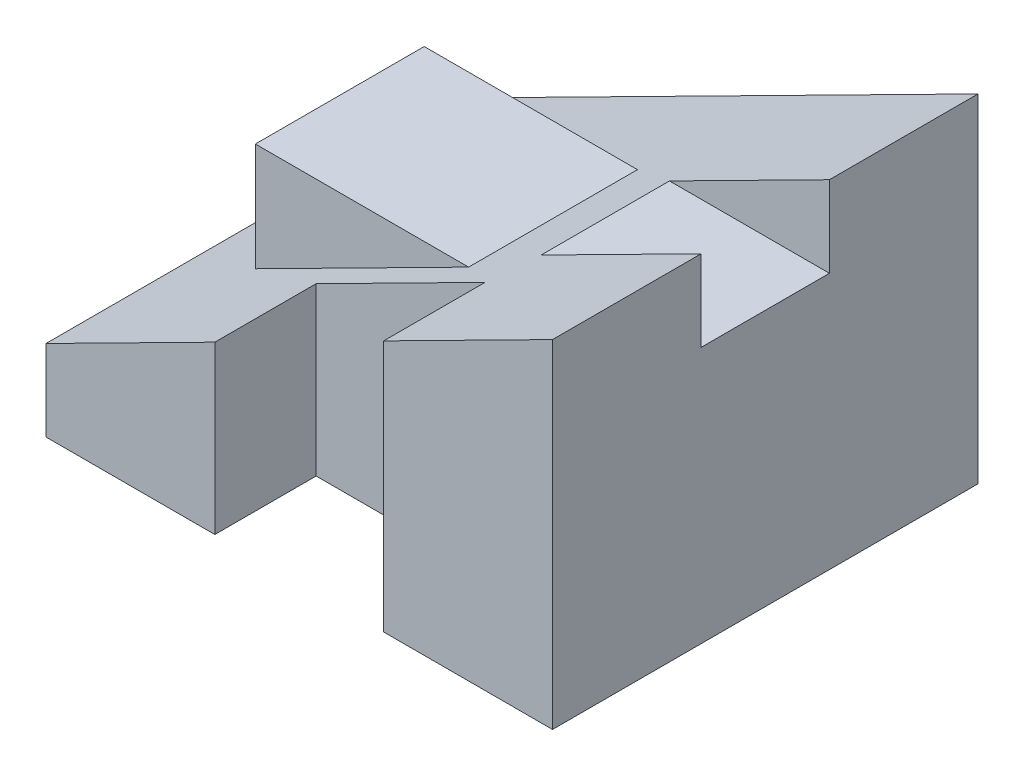
ISO-10303-21;
HEADER;
FILE_DESCRIPTION(('STEP AP214'),'2;1');
FILE_NAME('part.step','',(''),(''),'','','');
FILE_SCHEMA(('AUTOMOTIVE_DESIGN { 1 0 10303 214 1 1 1 1 }'));
ENDSEC;
DATA;
#1=APPLICATION_CONTEXT('core data for automotive mechanical design processes');
#2=APPLICATION_PROTOCOL_DEFINITION('international standard','automotive_design',2000,#1);
#3=PRODUCT_CONTEXT('',#1,'mechanical');
#4=PRODUCT('Part','Part','',(#3));
#5=PRODUCT_RELATED_PRODUCT_CATEGORY('part','',(#4));
#6=PRODUCT_DEFINITION_FORMATION('','',#4);
#7=PRODUCT_DEFINITION_CONTEXT('part definition',#1,'design');
#8=PRODUCT_DEFINITION('design','',#6,#7);
#9=PRODUCT_DEFINITION_SHAPE('','',#8);
#10=(LENGTH_UNIT() NAMED_UNIT(*) SI_UNIT(.MILLI.,.METRE.));
#11=(NAMED_UNIT(*) PLANE_ANGLE_UNIT() SI_UNIT($,.RADIAN.));
#12=(NAMED_UNIT(*) SI_UNIT($,.STERADIAN.) SOLID_ANGLE_UNIT());
#13=UNCERTAINTY_MEASURE_WITH_UNIT(LENGTH_MEASURE(1.E-05),#10,'distance_accuracy_value','');
#14=(GEOMETRIC_REPRESENTATION_CONTEXT(3) GLOBAL_UNCERTAINTY_ASSIGNED_CONTEXT((#13)) GLOBAL_UNIT_ASSIGNED_CONTEXT((#10,
#11,#12)) REPRESENTATION_CONTEXT('',''));
#15=CARTESIAN_POINT('',(0.,0.,0.));
#16=DIRECTION('',(0.,0.,1.));
#17=DIRECTION('',(1.,0.,0.));
#18=AXIS2_PLACEMENT_3D('',#15,#16,#17);
#19=CARTESIAN_POINT('',(0.,-18.0528375733855,-63.));
#20=DIRECTION('',(0.,-1.,0.));
#21=DIRECTION('',(0.,0.,-1.));
#22=AXIS2_PLACEMENT_3D('',#19,#20,#21);
#23=PLANE('',#22);
#24=DIRECTION('',(1.,0.,0.));
#25=VECTOR('',#24,1.);
#26=CARTESIAN_POINT('',(0.,-18.0528375733855,0.));
#27=LINE('',#26,#25);
#28=CARTESIAN_POINT('',(13.4189070516964,-18.0528375733855,0.));
#29=VERTEX_POINT('',#28);
#30=CARTESIAN_POINT('',(38.4189070516964,-18.0528375733855,0.));
#31=VERTEX_POINT('',#30);
#32=EDGE_CURVE('E226',#29,#31,#27,.T.);
#33=ORIENTED_EDGE('',*,*,#32,.F.);
#34=DIRECTION('',(0.,0.,-1.));
#35=VECTOR('',#34,1.);
#36=CARTESIAN_POINT('',(13.4189070516964,-18.0528375733855,-15.));
#37=LINE('',#36,#35);
#38=CARTESIAN_POINT('',(13.4189070516964,-18.0528375733855,-15.));
#39=VERTEX_POINT('',#38);
#40=EDGE_CURVE('E257',#29,#39,#37,.T.);
#41=ORIENTED_EDGE('',*,*,#40,.T.);
#42=DIRECTION('',(-1.,0.,0.));
#43=VECTOR('',#42,1.);
#44=CARTESIAN_POINT('',(-11.5810929483036,-18.0528375733855,-15.));
#45=LINE('',#44,#43);
#46=CARTESIAN_POINT('',(-11.5810929483036,-18.0528375733855,-15.));
#47=VERTEX_POINT('',#46);
#48=EDGE_CURVE('E303',#39,#47,#45,.T.);
#49=ORIENTED_EDGE('',*,*,#48,.T.);
#50=DIRECTION('',(0.,0.,1.));
#51=VECTOR('',#50,1.);
#52=CARTESIAN_POINT('',(-11.5810929483036,-18.0528375733855,-15.));
#53=LINE('',#52,#51);
#54=CARTESIAN_POINT('',(-11.5810929483036,-18.0528375733855,0.));
#55=VERTEX_POINT('',#54);
#56=EDGE_CURVE('E298',#47,#55,#53,.T.);
#57=ORIENTED_EDGE('',*,*,#56,.T.);
#58=CARTESIAN_POINT('',(-36.5810929483036,-18.0528375733855,0.));
#59=VERTEX_POINT('',#58);
#60=EDGE_CURVE('E227',#59,#55,#27,.T.);
#61=ORIENTED_EDGE('',*,*,#60,.F.);
#62=DIRECTION('',(0.,0.,1.));
#63=VECTOR('',#62,1.);
#64=CARTESIAN_POINT('',(-36.5810929483036,-18.0528375733855,-63.));
#65=LINE('',#64,#63);
#66=CARTESIAN_POINT('',(-36.5810929483036,-18.0528375733855,-63.));
#67=VERTEX_POINT('',#66);
#68=EDGE_CURVE('E191',#67,#59,#65,.T.);
#69=ORIENTED_EDGE('',*,*,#68,.F.);
#70=DIRECTION('',(1.,0.,0.));
#71=VECTOR('',#70,1.);
#72=CARTESIAN_POINT('',(0.,-18.0528375733855,-63.));
#73=LINE('',#72,#71);
#74=CARTESIAN_POINT('',(38.4189070516964,-18.0528375733855,-63.));
#75=VERTEX_POINT('',#74);
#76=EDGE_CURVE('E210',#67,#75,#73,.T.);
#77=ORIENTED_EDGE('',*,*,#76,.T.);
#78=DIRECTION('',(0.,0.,1.));
#79=VECTOR('',#78,1.);
#80=CARTESIAN_POINT('',(38.4189070516964,-18.0528375733855,-63.));
#81=LINE('',#80,#79);
#82=EDGE_CURVE('E183',#75,#31,#81,.T.);
#83=ORIENTED_EDGE('',*,*,#82,.T.);
#84=EDGE_LOOP('',(#33,#41,#49,#57,#61,#69,#77,#83));
#85=FACE_BOUND('',#84,.T.);
#86=ADVANCED_FACE('F45',(#85),#23,.T.);
#87=CARTESIAN_POINT('',(-5.03218434477319,9.93194278573655,-63.));
#88=DIRECTION('',(-0.451964793188669,0.892035776030268,0.));
#89=DIRECTION('',(-0.892035776030269,-0.45196479318867,0.));
#90=AXIS2_PLACEMENT_3D('',#87,#88,#89);
#91=PLANE('',#90);
#92=DIRECTION('',(0.892035776030269,0.45196479318867,0.));
#93=VECTOR('',#92,1.);
#94=CARTESIAN_POINT('',(-21.2614756049735,1.70910188056837,-41.));
#95=LINE('',#94,#93);
#96=CARTESIAN_POINT('',(14.7346965253806,19.9471624266145,-41.));
#97=VERTEX_POINT('',#96);
#98=CARTESIAN_POINT('',(38.4189070516964,31.9471624266145,-41.));
#99=VERTEX_POINT('',#98);
#100=EDGE_CURVE('E152',#97,#99,#95,.T.);
#101=ORIENTED_EDGE('',*,*,#100,.T.);
#102=DIRECTION('',(0.,0.,1.));
#103=VECTOR('',#102,1.);
#104=CARTESIAN_POINT('',(38.4189070516964,31.9471624266145,-63.));
#105=LINE('',#104,#103);
#106=CARTESIAN_POINT('',(38.4189070516964,31.9471624266145,-63.));
#107=VERTEX_POINT('',#106);
#108=EDGE_CURVE('E167',#107,#99,#105,.T.);
#109=ORIENTED_EDGE('',*,*,#108,.F.);
#110=DIRECTION('',(-0.892035776030269,-0.45196479318867,0.));
#111=VECTOR('',#110,1.);
#112=CARTESIAN_POINT('',(-5.03218434477319,9.93194278573655,-63.));
#113=LINE('',#112,#111);
#114=CARTESIAN_POINT('',(-36.5810929483036,-6.05283757338553,-63.));
#115=VERTEX_POINT('',#114);
#116=EDGE_CURVE('E235',#107,#115,#113,.T.);
#117=ORIENTED_EDGE('',*,*,#116,.T.);
#118=DIRECTION('',(0.,0.,1.));
#119=VECTOR('',#118,1.);
#120=CARTESIAN_POINT('',(-36.5810929483036,-6.05283757338553,-63.));
#121=LINE('',#120,#119);
#122=CARTESIAN_POINT('',(-36.5810929483036,-6.05283757338553,0.));
#123=VERTEX_POINT('',#122);
#124=EDGE_CURVE('E194',#115,#123,#121,.T.);
#125=ORIENTED_EDGE('',*,*,#124,.T.);
#126=DIRECTION('',(-0.892035776030269,-0.45196479318867,0.));
#127=VECTOR('',#126,1.);
#128=CARTESIAN_POINT('',(-5.03218434477319,9.93194278573655,0.));
#129=LINE('',#128,#127);
#130=CARTESIAN_POINT('',(-11.5810929483036,6.61382909328114,0.));
#131=VERTEX_POINT('',#130);
#132=EDGE_CURVE('E223',#131,#123,#129,.T.);
#133=ORIENTED_EDGE('',*,*,#132,.F.);
#134=DIRECTION('',(0.,0.,-1.));
#135=VECTOR('',#134,1.);
#136=CARTESIAN_POINT('',(-11.5810929483036,6.61382909328114,-15.));
#137=LINE('',#136,#135);
#138=CARTESIAN_POINT('',(-11.5810929483036,6.61382909328114,-15.));
#139=VERTEX_POINT('',#138);
#140=EDGE_CURVE('E69',#131,#139,#137,.T.);
#141=ORIENTED_EDGE('',*,*,#140,.T.);
#142=DIRECTION('',(0.892035776030269,0.45196479318867,0.));
#143=VECTOR('',#142,1.);
#144=CARTESIAN_POINT('',(-5.03218434477319,9.93194278573655,-15.));
#145=LINE('',#144,#143);
#146=CARTESIAN_POINT('',(13.4189070516964,19.2804957599478,-15.));
#147=VERTEX_POINT('',#146);
#148=EDGE_CURVE('E11',#139,#147,#145,.T.);
#149=ORIENTED_EDGE('',*,*,#148,.T.);
#150=DIRECTION('',(0.,0.,1.));
#151=VECTOR('',#150,1.);
#152=CARTESIAN_POINT('',(13.4189070516964,19.2804957599478,-63.));
#153=LINE('',#152,#151);
#154=CARTESIAN_POINT('',(13.4189070516964,19.2804957599478,0.));
#155=VERTEX_POINT('',#154);
#156=EDGE_CURVE('E246',#147,#155,#153,.T.);
#157=ORIENTED_EDGE('',*,*,#156,.T.);
#158=CARTESIAN_POINT('',(38.4189070516964,31.9471624266145,0.));
#159=VERTEX_POINT('',#158);
#160=EDGE_CURVE('E218',#159,#155,#129,.T.);
#161=ORIENTED_EDGE('',*,*,#160,.F.);
#162=CARTESIAN_POINT('',(38.4189070516964,31.9471624266145,-22.));
#163=VERTEX_POINT('',#162);
#164=EDGE_CURVE('E178',#163,#159,#105,.T.);
#165=ORIENTED_EDGE('',*,*,#164,.F.);
#166=DIRECTION('',(-0.892035776030269,-0.45196479318867,0.));
#167=VECTOR('',#166,1.);
#168=CARTESIAN_POINT('',(-21.2614756049735,1.70910188056837,-22.));
#169=LINE('',#168,#167);
#170=CARTESIAN_POINT('',(14.7346965253806,19.9471624266145,-22.));
#171=VERTEX_POINT('',#170);
#172=EDGE_CURVE('E61',#163,#171,#169,.T.);
#173=ORIENTED_EDGE('',*,*,#172,.T.);
#174=DIRECTION('',(0.,0.,-1.));
#175=VECTOR('',#174,1.);
#176=CARTESIAN_POINT('',(14.7346965253806,19.9471624266145,-22.));
#177=LINE('',#176,#175);
#178=EDGE_CURVE('E169',#171,#97,#177,.T.);
#179=ORIENTED_EDGE('',*,*,#178,.T.);
#180=EDGE_LOOP('',(#101,#109,#117,#125,#133,#141,#149,#157,#161,#165,#173,#179));
#181=FACE_BOUND('',#180,.T.);
#182=DIRECTION('',(0.,0.,1.));
#183=VECTOR('',#182,1.);
#184=CARTESIAN_POINT('',(-24.5810929483036,0.0271624266144754,-63.));
#185=LINE('',#184,#183);
#186=CARTESIAN_POINT('',(-24.5810929483036,0.0271624266144754,-44.));
#187=VERTEX_POINT('',#186);
#188=CARTESIAN_POINT('',(-24.5810929483036,0.0271624266144754,-19.));
#189=VERTEX_POINT('',#188);
#190=EDGE_CURVE('E198',#187,#189,#185,.T.);
#191=ORIENTED_EDGE('',*,*,#190,.F.);
#192=DIRECTION('',(-0.892035776030269,-0.451964793188669,0.));
#193=VECTOR('',#192,1.);
#194=CARTESIAN_POINT('',(-24.5810929483036,0.0271624266144754,-44.));
#195=LINE('',#194,#193);
#196=CARTESIAN_POINT('',(6.99785442011748,16.0271624266145,-44.));
#197=VERTEX_POINT('',#196);
#198=EDGE_CURVE('E250',#197,#187,#195,.T.);
#199=ORIENTED_EDGE('',*,*,#198,.F.);
#200=DIRECTION('',(0.,0.,1.));
#201=VECTOR('',#200,1.);
#202=CARTESIAN_POINT('',(6.99785442011748,16.0271624266145,-63.));
#203=LINE('',#202,#201);
#204=CARTESIAN_POINT('',(6.99785442011748,16.0271624266145,-19.));
#205=VERTEX_POINT('',#204);
#206=EDGE_CURVE('E204',#197,#205,#203,.T.);
#207=ORIENTED_EDGE('',*,*,#206,.T.);
#208=DIRECTION('',(0.892035776030269,0.451964793188669,0.));
#209=VECTOR('',#208,1.);
#210=CARTESIAN_POINT('',(6.99785442011748,16.0271624266145,-19.));
#211=LINE('',#210,#209);
#212=EDGE_CURVE('E271',#189,#205,#211,.T.);
#213=ORIENTED_EDGE('',*,*,#212,.F.);
#214=EDGE_LOOP('',(#191,#199,#207,#213));
#215=FACE_BOUND('',#214,.T.);
#216=ADVANCED_FACE('F165',(#181,#215),#91,.T.);
#217=CARTESIAN_POINT('',(0.,0.,0.));
#218=DIRECTION('',(0.,0.,1.));
#219=DIRECTION('',(1.,0.,0.));
#220=AXIS2_PLACEMENT_3D('',#217,#218,#219);
#221=PLANE('',#220);
#222=ORIENTED_EDGE('',*,*,#160,.T.);
#223=DIRECTION('',(0.,-1.,0.));
#224=VECTOR('',#223,1.);
#225=CARTESIAN_POINT('',(13.4189070516964,0.,0.));
#226=LINE('',#225,#224);
#227=EDGE_CURVE('E54',#155,#29,#226,.T.);
#228=ORIENTED_EDGE('',*,*,#227,.T.);
#229=ORIENTED_EDGE('',*,*,#32,.T.);
#230=DIRECTION('',(0.,1.,0.));
#231=VECTOR('',#230,1.);
#232=CARTESIAN_POINT('',(38.4189070516964,0.,0.));
#233=LINE('',#232,#231);
#234=EDGE_CURVE('E186',#31,#159,#233,.T.);
#235=ORIENTED_EDGE('',*,*,#234,.T.);
#236=EDGE_LOOP('',(#222,#228,#229,#235));
#237=FACE_BOUND('',#236,.T.);
#238=ADVANCED_FACE('F238',(#237),#221,.T.);
#239=CARTESIAN_POINT('',(-24.5810929483036,0.,-63.));
#240=DIRECTION('',(1.,0.,0.));
#241=DIRECTION('',(0.,0.,-1.));
#242=AXIS2_PLACEMENT_3D('',#239,#240,#241);
#243=PLANE('',#242);
#244=DIRECTION('',(0.,1.,0.));
#245=VECTOR('',#244,1.);
#246=CARTESIAN_POINT('',(-24.5810929483036,16.0271624266145,-44.));
#247=LINE('',#246,#245);
#248=CARTESIAN_POINT('',(-24.5810929483036,16.0271624266145,-44.));
#249=VERTEX_POINT('',#248);
#250=EDGE_CURVE('E255',#187,#249,#247,.T.);
#251=ORIENTED_EDGE('',*,*,#250,.F.);
#252=ORIENTED_EDGE('',*,*,#190,.T.);
#253=DIRECTION('',(0.,-1.,0.));
#254=VECTOR('',#253,1.);
#255=CARTESIAN_POINT('',(-24.5810929483036,0.0271624266144754,-19.));
#256=LINE('',#255,#254);
#257=CARTESIAN_POINT('',(-24.5810929483036,16.0271624266145,-19.));
#258=VERTEX_POINT('',#257);
#259=EDGE_CURVE('E267',#258,#189,#256,.T.);
#260=ORIENTED_EDGE('',*,*,#259,.F.);
#261=DIRECTION('',(0.,0.,1.));
#262=VECTOR('',#261,1.);
#263=CARTESIAN_POINT('',(-24.5810929483036,16.0271624266145,-63.));
#264=LINE('',#263,#262);
#265=EDGE_CURVE('E201',#249,#258,#264,.T.);
#266=ORIENTED_EDGE('',*,*,#265,.F.);
#267=EDGE_LOOP('',(#251,#252,#260,#266));
#268=FACE_BOUND('',#267,.T.);
#269=ADVANCED_FACE('F342',(#268),#243,.F.);
#270=CARTESIAN_POINT('',(0.,16.0271624266145,-63.));
#271=DIRECTION('',(0.,-1.,0.));
#272=DIRECTION('',(1.,0.,0.));
#273=AXIS2_PLACEMENT_3D('',#270,#271,#272);
#274=PLANE('',#273);
#275=DIRECTION('',(1.,0.,0.));
#276=VECTOR('',#275,1.);
#277=CARTESIAN_POINT('',(6.99785442011748,16.0271624266145,-44.));
#278=LINE('',#277,#276);
#279=EDGE_CURVE('E263',#249,#197,#278,.T.);
#280=ORIENTED_EDGE('',*,*,#279,.F.);
#281=ORIENTED_EDGE('',*,*,#265,.T.);
#282=DIRECTION('',(-1.,0.,0.));
#283=VECTOR('',#282,1.);
#284=CARTESIAN_POINT('',(-24.5810929483036,16.0271624266145,-19.));
#285=LINE('',#284,#283);
#286=EDGE_CURVE('E274',#205,#258,#285,.T.);
#287=ORIENTED_EDGE('',*,*,#286,.F.);
#288=ORIENTED_EDGE('',*,*,#206,.F.);
#289=EDGE_LOOP('',(#280,#281,#287,#288));
#290=FACE_BOUND('',#289,.T.);
#291=ADVANCED_FACE('F47',(#290),#274,.F.);
#292=CARTESIAN_POINT('',(38.4189070516964,0.,-63.));
#293=DIRECTION('',(1.,0.,0.));
#294=DIRECTION('',(0.,0.,-1.));
#295=AXIS2_PLACEMENT_3D('',#292,#293,#294);
#296=PLANE('',#295);
#297=DIRECTION('',(0.,1.,0.));
#298=VECTOR('',#297,1.);
#299=CARTESIAN_POINT('',(38.4189070516964,31.9471624266145,-41.));
#300=LINE('',#299,#298);
#301=CARTESIAN_POINT('',(38.4189070516964,19.9471624266145,-41.));
#302=VERTEX_POINT('',#301);
#303=EDGE_CURVE('E149',#302,#99,#300,.T.);
#304=ORIENTED_EDGE('',*,*,#303,.F.);
#305=DIRECTION('',(0.,0.,-1.));
#306=VECTOR('',#305,1.);
#307=CARTESIAN_POINT('',(38.4189070516964,19.9471624266145,-22.));
#308=LINE('',#307,#306);
#309=CARTESIAN_POINT('',(38.4189070516964,19.9471624266145,-22.));
#310=VERTEX_POINT('',#309);
#311=EDGE_CURVE('E161',#310,#302,#308,.T.);
#312=ORIENTED_EDGE('',*,*,#311,.F.);
#313=DIRECTION('',(0.,-1.,0.));
#314=VECTOR('',#313,1.);
#315=CARTESIAN_POINT('',(38.4189070516964,31.9471624266145,-22.));
#316=LINE('',#315,#314);
#317=EDGE_CURVE('E171',#163,#310,#316,.T.);
#318=ORIENTED_EDGE('',*,*,#317,.F.);
#319=ORIENTED_EDGE('',*,*,#164,.T.);
#320=ORIENTED_EDGE('',*,*,#234,.F.);
#321=ORIENTED_EDGE('',*,*,#82,.F.);
#322=DIRECTION('',(0.,1.,0.));
#323=VECTOR('',#322,1.);
#324=CARTESIAN_POINT('',(38.4189070516964,0.,-63.));
#325=LINE('',#324,#323);
#326=EDGE_CURVE('E176',#75,#107,#325,.T.);
#327=ORIENTED_EDGE('',*,*,#326,.T.);
#328=ORIENTED_EDGE('',*,*,#108,.T.);
#329=EDGE_LOOP('',(#304,#312,#318,#319,#320,#321,#327,#328));
#330=FACE_BOUND('',#329,.T.);
#331=ADVANCED_FACE('F174',(#330),#296,.T.);
#332=CARTESIAN_POINT('',(-36.5810929483036,0.,-63.));
#333=DIRECTION('',(-1.,0.,0.));
#334=DIRECTION('',(0.,0.,1.));
#335=AXIS2_PLACEMENT_3D('',#332,#333,#334);
#336=PLANE('',#335);
#337=DIRECTION('',(0.,-1.,0.));
#338=VECTOR('',#337,1.);
#339=CARTESIAN_POINT('',(-36.5810929483036,0.,0.));
#340=LINE('',#339,#338);
#341=EDGE_CURVE('E222',#123,#59,#340,.T.);
#342=ORIENTED_EDGE('',*,*,#341,.F.);
#343=ORIENTED_EDGE('',*,*,#124,.F.);
#344=DIRECTION('',(0.,-1.,0.));
#345=VECTOR('',#344,1.);
#346=CARTESIAN_POINT('',(-36.5810929483036,0.,-63.));
#347=LINE('',#346,#345);
#348=EDGE_CURVE('E214',#115,#67,#347,.T.);
#349=ORIENTED_EDGE('',*,*,#348,.T.);
#350=ORIENTED_EDGE('',*,*,#68,.T.);
#351=EDGE_LOOP('',(#342,#343,#349,#350));
#352=FACE_BOUND('',#351,.T.);
#353=ADVANCED_FACE('F285',(#352),#336,.T.);
#354=CARTESIAN_POINT('',(0.,0.,-63.));
#355=DIRECTION('',(0.,0.,1.));
#356=DIRECTION('',(1.,0.,0.));
#357=AXIS2_PLACEMENT_3D('',#354,#355,#356);
#358=PLANE('',#357);
#359=ORIENTED_EDGE('',*,*,#348,.F.);
#360=ORIENTED_EDGE('',*,*,#116,.F.);
#361=ORIENTED_EDGE('',*,*,#326,.F.);
#362=ORIENTED_EDGE('',*,*,#76,.F.);
#363=EDGE_LOOP('',(#359,#360,#361,#362));
#364=FACE_BOUND('',#363,.T.);
#365=ADVANCED_FACE('F287',(#364),#358,.F.);
#366=DIRECTION('',(0.,1.,0.));
#367=VECTOR('',#366,1.);
#368=CARTESIAN_POINT('',(-11.5810929483036,-18.0538375733855,0.));
#369=LINE('',#368,#367);
#370=EDGE_CURVE('E290',#55,#131,#369,.T.);
#371=ORIENTED_EDGE('',*,*,#370,.T.);
#372=ORIENTED_EDGE('',*,*,#132,.T.);
#373=ORIENTED_EDGE('',*,*,#341,.T.);
#374=ORIENTED_EDGE('',*,*,#60,.T.);
#375=EDGE_LOOP('',(#371,#372,#373,#374));
#376=FACE_BOUND('',#375,.T.);
#377=ADVANCED_FACE('F289',(#376),#221,.T.);
#378=CARTESIAN_POINT('',(0.,0.,-19.));
#379=DIRECTION('',(0.,0.,-1.));
#380=DIRECTION('',(-1.,0.,0.));
#381=AXIS2_PLACEMENT_3D('',#378,#379,#380);
#382=PLANE('',#381);
#383=ORIENTED_EDGE('',*,*,#259,.T.);
#384=ORIENTED_EDGE('',*,*,#212,.T.);
#385=ORIENTED_EDGE('',*,*,#286,.T.);
#386=EDGE_LOOP('',(#383,#384,#385));
#387=FACE_BOUND('',#386,.T.);
#388=ADVANCED_FACE('F358',(#387),#382,.F.);
#389=CARTESIAN_POINT('',(0.,0.,-44.));
#390=DIRECTION('',(0.,0.,-1.));
#391=DIRECTION('',(-1.,0.,0.));
#392=AXIS2_PLACEMENT_3D('',#389,#390,#391);
#393=PLANE('',#392);
#394=ORIENTED_EDGE('',*,*,#198,.T.);
#395=ORIENTED_EDGE('',*,*,#250,.T.);
#396=ORIENTED_EDGE('',*,*,#279,.T.);
#397=EDGE_LOOP('',(#394,#395,#396));
#398=FACE_BOUND('',#397,.T.);
#399=ADVANCED_FACE('F359',(#398),#393,.T.);
#400=CARTESIAN_POINT('',(13.4189070516964,31.9471624266145,-15.));
#401=DIRECTION('',(-1.,0.,0.));
#402=DIRECTION('',(0.,-1.,0.));
#403=AXIS2_PLACEMENT_3D('',#400,#401,#402);
#404=PLANE('',#403);
#405=DIRECTION('',(0.,-1.,0.));
#406=VECTOR('',#405,1.);
#407=CARTESIAN_POINT('',(13.4189070516964,31.9471624266145,-15.));
#408=LINE('',#407,#406);
#409=EDGE_CURVE('E251',#147,#39,#408,.T.);
#410=ORIENTED_EDGE('',*,*,#409,.T.);
#411=ORIENTED_EDGE('',*,*,#40,.F.);
#412=ORIENTED_EDGE('',*,*,#227,.F.);
#413=ORIENTED_EDGE('',*,*,#156,.F.);
#414=EDGE_LOOP('',(#410,#411,#412,#413));
#415=FACE_BOUND('',#414,.T.);
#416=ADVANCED_FACE('F361',(#415),#404,.T.);
#417=CARTESIAN_POINT('',(-11.5810929483036,31.9471624266145,-15.));
#418=DIRECTION('',(0.,0.,1.));
#419=DIRECTION('',(1.,0.,0.));
#420=AXIS2_PLACEMENT_3D('',#417,#418,#419);
#421=PLANE('',#420);
#422=ORIENTED_EDGE('',*,*,#148,.F.);
#423=DIRECTION('',(0.,1.,0.));
#424=VECTOR('',#423,1.);
#425=CARTESIAN_POINT('',(-11.5810929483036,-18.0538375733855,-15.));
#426=LINE('',#425,#424);
#427=EDGE_CURVE('E294',#47,#139,#426,.T.);
#428=ORIENTED_EDGE('',*,*,#427,.F.);
#429=ORIENTED_EDGE('',*,*,#48,.F.);
#430=ORIENTED_EDGE('',*,*,#409,.F.);
#431=EDGE_LOOP('',(#422,#428,#429,#430));
#432=FACE_BOUND('',#431,.T.);
#433=ADVANCED_FACE('F367',(#432),#421,.T.);
#434=CARTESIAN_POINT('',(-11.5810929483036,-18.0538375733855,-15.));
#435=DIRECTION('',(-1.,0.,0.));
#436=DIRECTION('',(0.,-1.,0.));
#437=AXIS2_PLACEMENT_3D('',#434,#435,#436);
#438=PLANE('',#437);
#439=ORIENTED_EDGE('',*,*,#427,.T.);
#440=ORIENTED_EDGE('',*,*,#140,.F.);
#441=ORIENTED_EDGE('',*,*,#370,.F.);
#442=ORIENTED_EDGE('',*,*,#56,.F.);
#443=EDGE_LOOP('',(#439,#440,#441,#442));
#444=FACE_BOUND('',#443,.T.);
#445=ADVANCED_FACE('F330',(#444),#438,.F.);
#446=CARTESIAN_POINT('',(-36.5820929483036,31.9471624266145,-41.));
#447=DIRECTION('',(0.,0.,-1.));
#448=DIRECTION('',(-1.,0.,0.));
#449=AXIS2_PLACEMENT_3D('',#446,#447,#448);
#450=PLANE('',#449);
#451=DIRECTION('',(1.,0.,0.));
#452=VECTOR('',#451,1.);
#453=CARTESIAN_POINT('',(-36.5820929483036,19.9471624266145,-41.));
#454=LINE('',#453,#452);
#455=EDGE_CURVE('E154',#97,#302,#454,.T.);
#456=ORIENTED_EDGE('',*,*,#455,.T.);
#457=ORIENTED_EDGE('',*,*,#303,.T.);
#458=ORIENTED_EDGE('',*,*,#100,.F.);
#459=EDGE_LOOP('',(#456,#457,#458));
#460=FACE_BOUND('',#459,.T.);
#461=ADVANCED_FACE('F151',(#460),#450,.F.);
#462=CARTESIAN_POINT('',(-36.5820929483036,19.9471624266145,-22.));
#463=DIRECTION('',(0.,-1.,0.));
#464=DIRECTION('',(0.,0.,-1.));
#465=AXIS2_PLACEMENT_3D('',#462,#463,#464);
#466=PLANE('',#465);
#467=DIRECTION('',(1.,0.,0.));
#468=VECTOR('',#467,1.);
#469=CARTESIAN_POINT('',(-36.5820929483036,19.9471624266145,-22.));
#470=LINE('',#469,#468);
#471=EDGE_CURVE('E160',#171,#310,#470,.T.);
#472=ORIENTED_EDGE('',*,*,#471,.T.);
#473=ORIENTED_EDGE('',*,*,#311,.T.);
#474=ORIENTED_EDGE('',*,*,#455,.F.);
#475=ORIENTED_EDGE('',*,*,#178,.F.);
#476=EDGE_LOOP('',(#472,#473,#474,#475));
#477=FACE_BOUND('',#476,.T.);
#478=ADVANCED_FACE('F322',(#477),#466,.F.);
#479=CARTESIAN_POINT('',(-36.5820929483036,31.9471624266145,-22.));
#480=DIRECTION('',(0.,0.,1.));
#481=DIRECTION('',(0.,-1.,0.));
#482=AXIS2_PLACEMENT_3D('',#479,#480,#481);
#483=PLANE('',#482);
#484=ORIENTED_EDGE('',*,*,#317,.T.);
#485=ORIENTED_EDGE('',*,*,#471,.F.);
#486=ORIENTED_EDGE('',*,*,#172,.F.);
#487=EDGE_LOOP('',(#484,#485,#486));
#488=FACE_BOUND('',#487,.T.);
#489=ADVANCED_FACE('F320',(#488),#483,.F.);
#490=CLOSED_SHELL('',(#86,#216,#238,#269,#291,#331,#353,#365,#377,#388,#399,#416,#433,#445,#461,
#478,#489));
#491=MANIFOLD_SOLID_BREP('B2',#490);
#492=ADVANCED_BREP_SHAPE_REPRESENTATION('',(#18,#491),#14);
#493=SHAPE_DEFINITION_REPRESENTATION(#9,#492);
ENDSEC;
END-ISO-10303-21;
